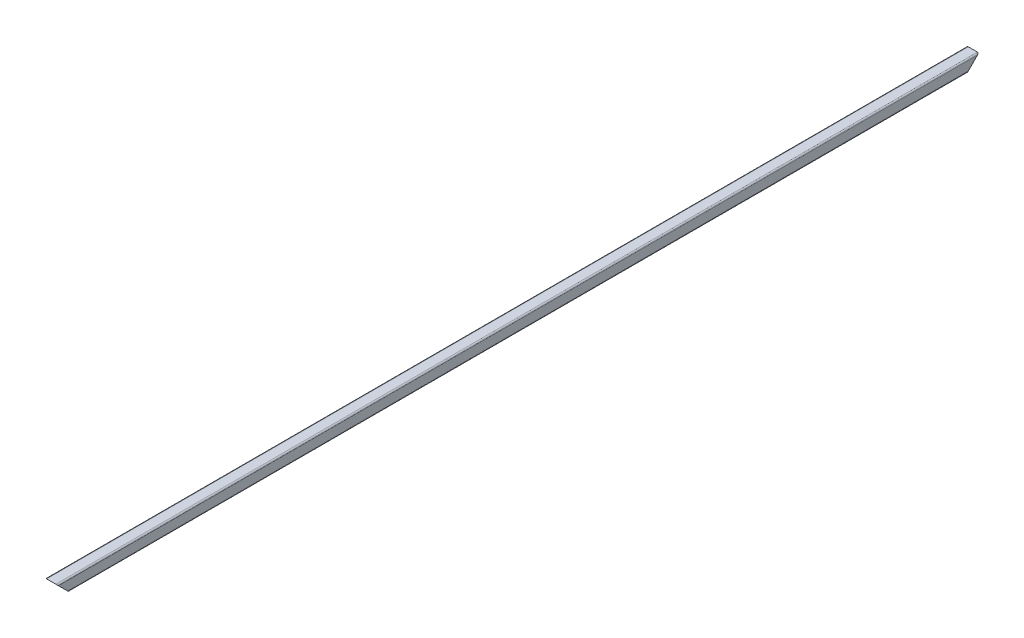
ISO-10303-21;
HEADER;
FILE_DESCRIPTION(('STEP AP214'),'2;1');
FILE_NAME('part.step','',(''),(''),'','','');
FILE_SCHEMA(('AUTOMOTIVE_DESIGN { 1 0 10303 214 1 1 1 1 }'));
ENDSEC;
DATA;
#1=APPLICATION_CONTEXT('core data for automotive mechanical design processes');
#2=APPLICATION_PROTOCOL_DEFINITION('international standard','automotive_design',2000,#1);
#3=PRODUCT_CONTEXT('',#1,'mechanical');
#4=PRODUCT('Part','Part','',(#3));
#5=PRODUCT_RELATED_PRODUCT_CATEGORY('part','',(#4));
#6=PRODUCT_DEFINITION_FORMATION('','',#4);
#7=PRODUCT_DEFINITION_CONTEXT('part definition',#1,'design');
#8=PRODUCT_DEFINITION('design','',#6,#7);
#9=PRODUCT_DEFINITION_SHAPE('','',#8);
#10=(LENGTH_UNIT() NAMED_UNIT(*) SI_UNIT(.MILLI.,.METRE.));
#11=(NAMED_UNIT(*) PLANE_ANGLE_UNIT() SI_UNIT($,.RADIAN.));
#12=(NAMED_UNIT(*) SI_UNIT($,.STERADIAN.) SOLID_ANGLE_UNIT());
#13=UNCERTAINTY_MEASURE_WITH_UNIT(LENGTH_MEASURE(1.E-05),#10,'distance_accuracy_value','');
#14=(GEOMETRIC_REPRESENTATION_CONTEXT(3) GLOBAL_UNCERTAINTY_ASSIGNED_CONTEXT((#13)) GLOBAL_UNIT_ASSIGNED_CONTEXT((#10,
#11,#12)) REPRESENTATION_CONTEXT('',''));
#15=CARTESIAN_POINT('',(0.,0.,0.));
#16=DIRECTION('',(0.,0.,1.));
#17=DIRECTION('',(1.,0.,0.));
#18=AXIS2_PLACEMENT_3D('',#15,#16,#17);
#19=CARTESIAN_POINT('',(-15.4999999999954,1944.50000000004,-3060.));
#20=DIRECTION('',(0.,0.,1.));
#21=DIRECTION('',(0.999999999999991,0.,0.));
#22=AXIS2_PLACEMENT_3D('',#19,#20,#21);
#23=CYLINDRICAL_SURFACE('',#22,4.5);
#24=CARTESIAN_POINT('',(-15.4999999999934,1944.50000000004,-15.4999999999976));
#25=DIRECTION('',(0.,-0.707106781186556,0.707106781186548));
#26=DIRECTION('',(0.,0.707106781186556,0.707106781186547));
#27=AXIS2_PLACEMENT_3D('',#24,#25,#26);
#28=ELLIPSE('',#27,6.36396103067893,4.5);
#29=CARTESIAN_POINT('',(-19.9999999999934,1944.50000000004,-15.4999999999998));
#30=VERTEX_POINT('',#29);
#31=CARTESIAN_POINT('',(-15.4999999999959,1940.00000000004,-19.9999999999951));
#32=VERTEX_POINT('',#31);
#33=EDGE_CURVE('E193',#30,#32,#28,.T.);
#34=ORIENTED_EDGE('',*,*,#33,.F.);
#35=DIRECTION('',(0.,0.,1.));
#36=VECTOR('',#35,1.);
#37=CARTESIAN_POINT('',(-19.9999999999956,1944.50000000004,-3060.));
#38=LINE('',#37,#36);
#39=CARTESIAN_POINT('',(-19.9999999999956,1944.50000000004,-3044.5));
#40=VERTEX_POINT('',#39);
#41=EDGE_CURVE('E69',#40,#30,#38,.T.);
#42=ORIENTED_EDGE('',*,*,#41,.F.);
#43=CARTESIAN_POINT('',(-15.4999999999956,1944.50000000004,-3044.5));
#44=DIRECTION('',(0.,-0.707106781186556,-0.707106781186548));
#45=DIRECTION('',(0.,-0.707106781186556,0.707106781186547));
#46=AXIS2_PLACEMENT_3D('',#43,#44,#45);
#47=ELLIPSE('',#46,6.36396103067893,4.5);
#48=CARTESIAN_POINT('',(-15.4999999999954,1940.00000000004,-3040.));
#49=VERTEX_POINT('',#48);
#50=EDGE_CURVE('E210',#49,#40,#47,.T.);
#51=ORIENTED_EDGE('',*,*,#50,.F.);
#52=DIRECTION('',(0.,0.,1.));
#53=VECTOR('',#52,1.);
#54=CARTESIAN_POINT('',(-15.499999999995,1940.00000000004,-3060.));
#55=LINE('',#54,#53);
#56=EDGE_CURVE('E235',#49,#32,#55,.T.);
#57=ORIENTED_EDGE('',*,*,#56,.T.);
#58=EDGE_LOOP('',(#34,#42,#51,#57));
#59=FACE_BOUND('',#58,.T.);
#60=ADVANCED_FACE('F54',(#59),#23,.T.);
#61=CARTESIAN_POINT('',(-19.9999999999956,1944.50000000004,-3060.));
#62=DIRECTION('',(0.999999999999991,0.,0.));
#63=DIRECTION('',(0.,0.,-1.));
#64=AXIS2_PLACEMENT_3D('',#61,#62,#63);
#65=PLANE('',#64);
#66=DIRECTION('',(0.,-0.707106781186556,-0.707106781186547));
#67=VECTOR('',#66,1.);
#68=CARTESIAN_POINT('',(-20.0000000000022,422.250000000009,-1537.75));
#69=LINE('',#68,#67);
#70=CARTESIAN_POINT('',(-19.9999999999956,1975.50000000003,15.4999999999979));
#71=VERTEX_POINT('',#70);
#72=EDGE_CURVE('E289',#71,#30,#69,.T.);
#73=ORIENTED_EDGE('',*,*,#72,.F.);
#74=DIRECTION('',(0.,0.,1.));
#75=VECTOR('',#74,1.);
#76=CARTESIAN_POINT('',(-19.9999999999978,1975.50000000004,-3060.00000000001));
#77=LINE('',#76,#75);
#78=CARTESIAN_POINT('',(-20.,1975.50000000003,-3075.50000000001));
#79=VERTEX_POINT('',#78);
#80=EDGE_CURVE('E207',#79,#71,#77,.T.);
#81=ORIENTED_EDGE('',*,*,#80,.F.);
#82=DIRECTION('',(0.,0.707106781186556,-0.707106781186547));
#83=VECTOR('',#82,1.);
#84=CARTESIAN_POINT('',(-19.9999999999978,1952.25000000003,-3052.25));
#85=LINE('',#84,#83);
#86=EDGE_CURVE('E359',#40,#79,#85,.T.);
#87=ORIENTED_EDGE('',*,*,#86,.F.);
#88=ORIENTED_EDGE('',*,*,#41,.T.);
#89=EDGE_LOOP('',(#73,#81,#87,#88));
#90=FACE_BOUND('',#89,.T.);
#91=ADVANCED_FACE('F373',(#90),#65,.F.);
#92=CARTESIAN_POINT('',(-15.4999999999978,1975.50000000004,-3060.));
#93=DIRECTION('',(0.,0.,1.));
#94=DIRECTION('',(0.999999999999991,0.,0.));
#95=AXIS2_PLACEMENT_3D('',#92,#93,#94);
#96=CYLINDRICAL_SURFACE('',#95,4.5);
#97=CARTESIAN_POINT('',(-15.4999999999956,1975.50000000004,15.5000000000016));
#98=DIRECTION('',(0.,-0.707106781186556,0.707106781186548));
#99=DIRECTION('',(0.,0.707106781186556,0.707106781186547));
#100=AXIS2_PLACEMENT_3D('',#97,#98,#99);
#101=ELLIPSE('',#100,6.36396103067893,4.5);
#102=CARTESIAN_POINT('',(-15.4999999999978,1980.00000000003,20.0000000000014));
#103=VERTEX_POINT('',#102);
#104=EDGE_CURVE('E293',#103,#71,#101,.T.);
#105=ORIENTED_EDGE('',*,*,#104,.F.);
#106=DIRECTION('',(0.,0.,1.));
#107=VECTOR('',#106,1.);
#108=CARTESIAN_POINT('',(-15.4999999999979,1980.00000000004,-3060.));
#109=LINE('',#108,#107);
#110=CARTESIAN_POINT('',(-15.4999999999979,1980.00000000003,-3080.));
#111=VERTEX_POINT('',#110);
#112=EDGE_CURVE('E254',#111,#103,#109,.T.);
#113=ORIENTED_EDGE('',*,*,#112,.F.);
#114=CARTESIAN_POINT('',(-15.4999999999998,1975.50000000004,-3075.5));
#115=DIRECTION('',(0.,-0.707106781186556,-0.707106781186548));
#116=DIRECTION('',(0.,-0.707106781186556,0.707106781186547));
#117=AXIS2_PLACEMENT_3D('',#114,#115,#116);
#118=ELLIPSE('',#117,6.36396103067893,4.5);
#119=EDGE_CURVE('E356',#79,#111,#118,.T.);
#120=ORIENTED_EDGE('',*,*,#119,.F.);
#121=ORIENTED_EDGE('',*,*,#80,.T.);
#122=EDGE_LOOP('',(#105,#113,#120,#121));
#123=FACE_BOUND('',#122,.T.);
#124=ADVANCED_FACE('F375',(#123),#96,.T.);
#125=CARTESIAN_POINT('',(-15.4999999999979,1980.00000000004,-3060.));
#126=DIRECTION('',(0.,-1.00000000000002,0.));
#127=DIRECTION('',(0.,0.,-1.));
#128=AXIS2_PLACEMENT_3D('',#125,#126,#127);
#129=PLANE('',#128);
#130=DIRECTION('',(-0.999999999999991,0.,0.));
#131=VECTOR('',#130,1.);
#132=CARTESIAN_POINT('',(-15.4999999999978,1980.00000000003,20.0000000000022));
#133=LINE('',#132,#131);
#134=CARTESIAN_POINT('',(15.5000000000023,1980.00000000003,20.0000000000005));
#135=VERTEX_POINT('',#134);
#136=EDGE_CURVE('E297',#135,#103,#133,.T.);
#137=ORIENTED_EDGE('',*,*,#136,.F.);
#138=DIRECTION('',(0.,0.,1.));
#139=VECTOR('',#138,1.);
#140=CARTESIAN_POINT('',(15.5000000000023,1980.00000000003,-3060.));
#141=LINE('',#140,#139);
#142=CARTESIAN_POINT('',(15.5000000000023,1980.00000000003,-3080.));
#143=VERTEX_POINT('',#142);
#144=EDGE_CURVE('E250',#143,#135,#141,.T.);
#145=ORIENTED_EDGE('',*,*,#144,.F.);
#146=DIRECTION('',(0.999999999999991,0.,0.));
#147=VECTOR('',#146,1.);
#148=CARTESIAN_POINT('',(-15.4999999999979,1980.00000000003,-3080.));
#149=LINE('',#148,#147);
#150=EDGE_CURVE('E352',#111,#143,#149,.T.);
#151=ORIENTED_EDGE('',*,*,#150,.F.);
#152=ORIENTED_EDGE('',*,*,#112,.T.);
#153=EDGE_LOOP('',(#137,#145,#151,#152));
#154=FACE_BOUND('',#153,.T.);
#155=ADVANCED_FACE('F379',(#154),#129,.F.);
#156=CARTESIAN_POINT('',(15.5000000000023,1975.50000000004,-3060.));
#157=DIRECTION('',(0.,0.,1.));
#158=DIRECTION('',(0.999999999999991,0.,0.));
#159=AXIS2_PLACEMENT_3D('',#156,#157,#158);
#160=CYLINDRICAL_SURFACE('',#159,4.5);
#161=CARTESIAN_POINT('',(15.500000000004,1975.50000000003,15.5000000000016));
#162=DIRECTION('',(0.,-0.707106781186556,0.707106781186548));
#163=DIRECTION('',(0.,0.707106781186556,0.707106781186547));
#164=AXIS2_PLACEMENT_3D('',#161,#162,#163);
#165=ELLIPSE('',#164,6.36396103067893,4.5);
#166=CARTESIAN_POINT('',(20.0000000000042,1975.50000000004,15.4999999999994));
#167=VERTEX_POINT('',#166);
#168=EDGE_CURVE('E301',#167,#135,#165,.T.);
#169=ORIENTED_EDGE('',*,*,#168,.F.);
#170=DIRECTION('',(0.,0.,1.));
#171=VECTOR('',#170,1.);
#172=CARTESIAN_POINT('',(20.0000000000022,1975.50000000004,-3060.));
#173=LINE('',#172,#171);
#174=CARTESIAN_POINT('',(20.,1975.50000000004,-3075.5));
#175=VERTEX_POINT('',#174);
#176=EDGE_CURVE('E246',#175,#167,#173,.T.);
#177=ORIENTED_EDGE('',*,*,#176,.F.);
#178=CARTESIAN_POINT('',(15.5,1975.50000000003,-3075.5));
#179=DIRECTION('',(0.,-0.707106781186556,-0.707106781186548));
#180=DIRECTION('',(0.,-0.707106781186556,0.707106781186547));
#181=AXIS2_PLACEMENT_3D('',#178,#179,#180);
#182=ELLIPSE('',#181,6.36396103067893,4.5);
#183=EDGE_CURVE('E348',#143,#175,#182,.T.);
#184=ORIENTED_EDGE('',*,*,#183,.F.);
#185=ORIENTED_EDGE('',*,*,#144,.T.);
#186=EDGE_LOOP('',(#169,#177,#184,#185));
#187=FACE_BOUND('',#186,.T.);
#188=ADVANCED_FACE('F381',(#187),#160,.T.);
#189=CARTESIAN_POINT('',(20.0000000000044,1944.50000000004,-3060.));
#190=DIRECTION('',(-0.999999999999991,0.,0.));
#191=DIRECTION('',(0.,0.,1.));
#192=AXIS2_PLACEMENT_3D('',#189,#190,#191);
#193=PLANE('',#192);
#194=DIRECTION('',(0.,0.707106781186556,0.707106781186547));
#195=VECTOR('',#194,1.);
#196=CARTESIAN_POINT('',(19.9999999999978,422.250000000007,-1537.75));
#197=LINE('',#196,#195);
#198=CARTESIAN_POINT('',(20.0000000000051,1944.50000000004,-15.4999999999981));
#199=VERTEX_POINT('',#198);
#200=EDGE_CURVE('E305',#199,#167,#197,.T.);
#201=ORIENTED_EDGE('',*,*,#200,.F.);
#202=DIRECTION('',(0.,0.,1.));
#203=VECTOR('',#202,1.);
#204=CARTESIAN_POINT('',(20.0000000000044,1944.50000000004,-3060.));
#205=LINE('',#204,#203);
#206=CARTESIAN_POINT('',(20.0000000000044,1944.50000000004,-3044.5));
#207=VERTEX_POINT('',#206);
#208=EDGE_CURVE('E242',#207,#199,#205,.T.);
#209=ORIENTED_EDGE('',*,*,#208,.F.);
#210=DIRECTION('',(0.,-0.707106781186556,0.707106781186547));
#211=VECTOR('',#210,1.);
#212=CARTESIAN_POINT('',(20.0000000000009,1952.25000000004,-3052.24999999999));
#213=LINE('',#212,#211);
#214=EDGE_CURVE('E344',#175,#207,#213,.T.);
#215=ORIENTED_EDGE('',*,*,#214,.F.);
#216=ORIENTED_EDGE('',*,*,#176,.T.);
#217=EDGE_LOOP('',(#201,#209,#215,#216));
#218=FACE_BOUND('',#217,.T.);
#219=ADVANCED_FACE('F385',(#218),#193,.F.);
#220=CARTESIAN_POINT('',(15.5000000000045,1944.50000000004,-3060.));
#221=DIRECTION('',(0.,0.,1.));
#222=DIRECTION('',(0.999999999999991,0.,0.));
#223=AXIS2_PLACEMENT_3D('',#220,#221,#222);
#224=CYLINDRICAL_SURFACE('',#223,4.5);
#225=CARTESIAN_POINT('',(15.5000000000063,1944.50000000004,-15.4999999999976));
#226=DIRECTION('',(0.,-0.707106781186556,0.707106781186548));
#227=DIRECTION('',(0.,0.707106781186556,0.707106781186547));
#228=AXIS2_PLACEMENT_3D('',#225,#226,#227);
#229=ELLIPSE('',#228,6.36396103067893,4.5);
#230=CARTESIAN_POINT('',(15.5000000000027,1940.00000000004,-19.9999999999974));
#231=VERTEX_POINT('',#230);
#232=EDGE_CURVE('E309',#231,#199,#229,.T.);
#233=ORIENTED_EDGE('',*,*,#232,.F.);
#234=DIRECTION('',(0.,0.,1.));
#235=VECTOR('',#234,1.);
#236=CARTESIAN_POINT('',(15.5000000000045,1940.00000000004,-3060.));
#237=LINE('',#236,#235);
#238=CARTESIAN_POINT('',(15.5000000000045,1940.00000000004,-3040.));
#239=VERTEX_POINT('',#238);
#240=EDGE_CURVE('E238',#239,#231,#237,.T.);
#241=ORIENTED_EDGE('',*,*,#240,.F.);
#242=CARTESIAN_POINT('',(15.5000000000045,1944.50000000004,-3044.5));
#243=DIRECTION('',(0.,-0.707106781186556,-0.707106781186548));
#244=DIRECTION('',(0.,-0.707106781186556,0.707106781186547));
#245=AXIS2_PLACEMENT_3D('',#242,#243,#244);
#246=ELLIPSE('',#245,6.36396103067893,4.5);
#247=EDGE_CURVE('E340',#207,#239,#246,.T.);
#248=ORIENTED_EDGE('',*,*,#247,.F.);
#249=ORIENTED_EDGE('',*,*,#208,.T.);
#250=EDGE_LOOP('',(#233,#241,#248,#249));
#251=FACE_BOUND('',#250,.T.);
#252=ADVANCED_FACE('F387',(#251),#224,.T.);
#253=CARTESIAN_POINT('',(-15.499999999995,1940.00000000004,-3060.));
#254=DIRECTION('',(0.,1.00000000000002,0.));
#255=DIRECTION('',(0.,0.,1.));
#256=AXIS2_PLACEMENT_3D('',#253,#254,#255);
#257=PLANE('',#256);
#258=DIRECTION('',(0.999999999999991,0.,0.));
#259=VECTOR('',#258,1.);
#260=CARTESIAN_POINT('',(-15.4999999999959,1940.00000000004,-19.999999999996));
#261=LINE('',#260,#259);
#262=EDGE_CURVE('E273',#32,#231,#261,.T.);
#263=ORIENTED_EDGE('',*,*,#262,.F.);
#264=ORIENTED_EDGE('',*,*,#56,.F.);
#265=DIRECTION('',(-0.999999999999991,0.,0.));
#266=VECTOR('',#265,1.);
#267=CARTESIAN_POINT('',(-15.4999999999954,1940.00000000004,-3040.));
#268=LINE('',#267,#266);
#269=EDGE_CURVE('E336',#239,#49,#268,.T.);
#270=ORIENTED_EDGE('',*,*,#269,.F.);
#271=ORIENTED_EDGE('',*,*,#240,.T.);
#272=EDGE_LOOP('',(#263,#264,#270,#271));
#273=FACE_BOUND('',#272,.T.);
#274=ADVANCED_FACE('F389',(#273),#257,.F.);
#275=CARTESIAN_POINT('',(2.2065682614425E-12,1960.00000000004,-3060.00000000001));
#276=DIRECTION('',(0.,-0.707106781186556,-0.707106781186548));
#277=DIRECTION('',(0.,0.707106781186556,-0.707106781186547));
#278=AXIS2_PLACEMENT_3D('',#275,#276,#277);
#279=PLANE('',#278);
#280=CARTESIAN_POINT('',(-14.9999999999955,1945.00000000004,-3045.));
#281=DIRECTION('',(0.,-0.707106781186556,-0.707106781186548));
#282=DIRECTION('',(0.,-0.707106781186556,0.707106781186547));
#283=AXIS2_PLACEMENT_3D('',#280,#281,#282);
#284=ELLIPSE('',#283,4.24264068711928,3.);
#285=CARTESIAN_POINT('',(-14.9999999999955,1942.00000000004,-3042.));
#286=VERTEX_POINT('',#285);
#287=CARTESIAN_POINT('',(-17.9999999999956,1945.00000000003,-3045.));
#288=VERTEX_POINT('',#287);
#289=EDGE_CURVE('E198',#286,#288,#284,.T.);
#290=ORIENTED_EDGE('',*,*,#289,.F.);
#291=DIRECTION('',(-0.999999999999991,0.,0.));
#292=VECTOR('',#291,1.);
#293=CARTESIAN_POINT('',(-14.9999999999955,1942.00000000004,-3042.));
#294=LINE('',#293,#292);
#295=CARTESIAN_POINT('',(15.0000000000045,1942.00000000003,-3042.));
#296=VERTEX_POINT('',#295);
#297=EDGE_CURVE('E330',#296,#286,#294,.T.);
#298=ORIENTED_EDGE('',*,*,#297,.F.);
#299=CARTESIAN_POINT('',(15.0000000000045,1945.00000000003,-3045.));
#300=DIRECTION('',(0.,-0.707106781186556,-0.707106781186548));
#301=DIRECTION('',(0.,-0.707106781186556,0.707106781186547));
#302=AXIS2_PLACEMENT_3D('',#299,#300,#301);
#303=ELLIPSE('',#302,4.24264068711928,3.);
#304=CARTESIAN_POINT('',(18.0000000000044,1945.00000000004,-3045.00000000001));
#305=VERTEX_POINT('',#304);
#306=EDGE_CURVE('E326',#305,#296,#303,.T.);
#307=ORIENTED_EDGE('',*,*,#306,.F.);
#308=DIRECTION('',(0.,-0.707106781186556,0.707106781186547));
#309=VECTOR('',#308,1.);
#310=CARTESIAN_POINT('',(18.000000000002,1952.50000000004,-3052.5));
#311=LINE('',#310,#309);
#312=CARTESIAN_POINT('',(18.0000000000022,1975.00000000004,-3075.));
#313=VERTEX_POINT('',#312);
#314=EDGE_CURVE('E322',#313,#305,#311,.T.);
#315=ORIENTED_EDGE('',*,*,#314,.F.);
#316=CARTESIAN_POINT('',(15.0000000000023,1975.00000000004,-3075.));
#317=DIRECTION('',(0.,-0.707106781186556,-0.707106781186548));
#318=DIRECTION('',(0.,-0.707106781186556,0.707106781186547));
#319=AXIS2_PLACEMENT_3D('',#316,#317,#318);
#320=ELLIPSE('',#319,4.24264068711928,3.);
#321=CARTESIAN_POINT('',(15.0000000000023,1978.00000000004,-3078.));
#322=VERTEX_POINT('',#321);
#323=EDGE_CURVE('E318',#322,#313,#320,.T.);
#324=ORIENTED_EDGE('',*,*,#323,.F.);
#325=DIRECTION('',(0.999999999999991,0.,0.));
#326=VECTOR('',#325,1.);
#327=CARTESIAN_POINT('',(-14.9999999999977,1978.00000000004,-3078.));
#328=LINE('',#327,#326);
#329=CARTESIAN_POINT('',(-14.9999999999977,1978.00000000004,-3078.));
#330=VERTEX_POINT('',#329);
#331=EDGE_CURVE('E269',#330,#322,#328,.T.);
#332=ORIENTED_EDGE('',*,*,#331,.F.);
#333=CARTESIAN_POINT('',(-14.9999999999977,1975.00000000004,-3074.99999999999));
#334=DIRECTION('',(0.,-0.707106781186556,-0.707106781186548));
#335=DIRECTION('',(0.,-0.707106781186556,0.707106781186547));
#336=AXIS2_PLACEMENT_3D('',#333,#334,#335);
#337=ELLIPSE('',#336,4.24264068711928,3.);
#338=CARTESIAN_POINT('',(-17.9999999999978,1975.00000000004,-3075.));
#339=VERTEX_POINT('',#338);
#340=EDGE_CURVE('E267',#339,#330,#337,.T.);
#341=ORIENTED_EDGE('',*,*,#340,.F.);
#342=DIRECTION('',(0.,0.707106781186556,-0.707106781186547));
#343=VECTOR('',#342,1.);
#344=CARTESIAN_POINT('',(-17.9999999999978,1952.50000000004,-3052.5));
#345=LINE('',#344,#343);
#346=EDGE_CURVE('E62',#288,#339,#345,.T.);
#347=ORIENTED_EDGE('',*,*,#346,.F.);
#348=EDGE_LOOP('',(#290,#298,#307,#315,#324,#332,#341,#347));
#349=FACE_BOUND('',#348,.T.);
#350=ORIENTED_EDGE('',*,*,#269,.T.);
#351=ORIENTED_EDGE('',*,*,#50,.T.);
#352=ORIENTED_EDGE('',*,*,#86,.T.);
#353=ORIENTED_EDGE('',*,*,#119,.T.);
#354=ORIENTED_EDGE('',*,*,#150,.T.);
#355=ORIENTED_EDGE('',*,*,#183,.T.);
#356=ORIENTED_EDGE('',*,*,#214,.T.);
#357=ORIENTED_EDGE('',*,*,#247,.T.);
#358=EDGE_LOOP('',(#350,#351,#352,#353,#354,#355,#356,#357));
#359=FACE_BOUND('',#358,.T.);
#360=ADVANCED_FACE('F264',(#349,#359),#279,.T.);
#361=CARTESIAN_POINT('',(-14.9999999999955,1945.00000000004,-3060.));
#362=DIRECTION('',(0.,0.,1.));
#363=DIRECTION('',(0.999999999999991,0.,0.));
#364=AXIS2_PLACEMENT_3D('',#361,#362,#363);
#365=CYLINDRICAL_SURFACE('',#364,3.);
#366=DIRECTION('',(0.,0.,1.));
#367=VECTOR('',#366,1.);
#368=CARTESIAN_POINT('',(-17.9999999999956,1945.00000000004,-3060.));
#369=LINE('',#368,#367);
#370=CARTESIAN_POINT('',(-17.9999999999956,1945.00000000003,-15.0000000000019));
#371=VERTEX_POINT('',#370);
#372=EDGE_CURVE('E188',#288,#371,#369,.T.);
#373=ORIENTED_EDGE('',*,*,#372,.T.);
#374=CARTESIAN_POINT('',(-14.9999999999957,1945.00000000004,-14.9999999999997));
#375=DIRECTION('',(0.,-0.707106781186556,0.707106781186548));
#376=DIRECTION('',(0.,0.707106781186556,0.707106781186547));
#377=AXIS2_PLACEMENT_3D('',#374,#375,#376);
#378=ELLIPSE('',#377,4.24264068711928,3.);
#379=CARTESIAN_POINT('',(-14.9999999999957,1942.00000000004,-18.0000000000002));
#380=VERTEX_POINT('',#379);
#381=EDGE_CURVE('E13',#371,#380,#378,.T.);
#382=ORIENTED_EDGE('',*,*,#381,.T.);
#383=DIRECTION('',(0.,0.,1.));
#384=VECTOR('',#383,1.);
#385=CARTESIAN_POINT('',(-14.9999999999955,1942.00000000004,-3060.));
#386=LINE('',#385,#384);
#387=EDGE_CURVE('E232',#286,#380,#386,.T.);
#388=ORIENTED_EDGE('',*,*,#387,.F.);
#389=ORIENTED_EDGE('',*,*,#289,.T.);
#390=EDGE_LOOP('',(#373,#382,#388,#389));
#391=FACE_BOUND('',#390,.T.);
#392=ADVANCED_FACE('F197',(#391),#365,.F.);
#393=CARTESIAN_POINT('',(-14.9999999999955,1942.00000000004,-3060.));
#394=DIRECTION('',(0.,1.00000000000002,0.));
#395=DIRECTION('',(0.,0.,1.));
#396=AXIS2_PLACEMENT_3D('',#393,#394,#395);
#397=PLANE('',#396);
#398=ORIENTED_EDGE('',*,*,#387,.T.);
#399=DIRECTION('',(0.999999999999991,0.,0.));
#400=VECTOR('',#399,1.);
#401=CARTESIAN_POINT('',(-14.9999999999957,1942.00000000004,-18.0000000000002));
#402=LINE('',#401,#400);
#403=CARTESIAN_POINT('',(15.0000000000041,1942.00000000003,-18.0000000000025));
#404=VERTEX_POINT('',#403);
#405=EDGE_CURVE('E77',#380,#404,#402,.T.);
#406=ORIENTED_EDGE('',*,*,#405,.T.);
#407=DIRECTION('',(0.,0.,1.));
#408=VECTOR('',#407,1.);
#409=CARTESIAN_POINT('',(15.0000000000045,1942.00000000004,-3060.));
#410=LINE('',#409,#408);
#411=EDGE_CURVE('E228',#296,#404,#410,.T.);
#412=ORIENTED_EDGE('',*,*,#411,.F.);
#413=ORIENTED_EDGE('',*,*,#297,.T.);
#414=EDGE_LOOP('',(#398,#406,#412,#413));
#415=FACE_BOUND('',#414,.T.);
#416=ADVANCED_FACE('F448',(#415),#397,.T.);
#417=CARTESIAN_POINT('',(15.0000000000045,1945.00000000004,-3060.));
#418=DIRECTION('',(0.,0.,1.));
#419=DIRECTION('',(0.999999999999991,0.,0.));
#420=AXIS2_PLACEMENT_3D('',#417,#418,#419);
#421=CYLINDRICAL_SURFACE('',#420,3.);
#422=ORIENTED_EDGE('',*,*,#411,.T.);
#423=CARTESIAN_POINT('',(15.0000000000041,1945.00000000003,-14.9999999999997));
#424=DIRECTION('',(0.,-0.707106781186556,0.707106781186548));
#425=DIRECTION('',(0.,0.707106781186556,0.707106781186547));
#426=AXIS2_PLACEMENT_3D('',#423,#424,#425);
#427=ELLIPSE('',#426,4.24264068711928,3.);
#428=CARTESIAN_POINT('',(18.0000000000042,1945.00000000004,-15.0000000000019));
#429=VERTEX_POINT('',#428);
#430=EDGE_CURVE('E514',#404,#429,#427,.T.);
#431=ORIENTED_EDGE('',*,*,#430,.T.);
#432=DIRECTION('',(0.,0.,1.));
#433=VECTOR('',#432,1.);
#434=CARTESIAN_POINT('',(18.0000000000044,1945.00000000004,-3060.));
#435=LINE('',#434,#433);
#436=EDGE_CURVE('E224',#305,#429,#435,.T.);
#437=ORIENTED_EDGE('',*,*,#436,.F.);
#438=ORIENTED_EDGE('',*,*,#306,.T.);
#439=EDGE_LOOP('',(#422,#431,#437,#438));
#440=FACE_BOUND('',#439,.T.);
#441=ADVANCED_FACE('F454',(#440),#421,.F.);
#442=CARTESIAN_POINT('',(18.0000000000044,1945.00000000004,-3060.));
#443=DIRECTION('',(-0.999999999999991,0.,0.));
#444=DIRECTION('',(0.,0.,1.));
#445=AXIS2_PLACEMENT_3D('',#442,#443,#444);
#446=PLANE('',#445);
#447=ORIENTED_EDGE('',*,*,#436,.T.);
#448=DIRECTION('',(0.,0.707106781186556,0.707106781186547));
#449=VECTOR('',#448,1.);
#450=CARTESIAN_POINT('',(17.9999999999978,422.500000000009,-1537.5));
#451=LINE('',#450,#449);
#452=CARTESIAN_POINT('',(18.0000000000042,1975.00000000004,14.9999999999997));
#453=VERTEX_POINT('',#452);
#454=EDGE_CURVE('E511',#429,#453,#451,.T.);
#455=ORIENTED_EDGE('',*,*,#454,.T.);
#456=DIRECTION('',(0.,0.,1.));
#457=VECTOR('',#456,1.);
#458=CARTESIAN_POINT('',(18.0000000000022,1975.00000000004,-3060.));
#459=LINE('',#458,#457);
#460=EDGE_CURVE('E220',#313,#453,#459,.T.);
#461=ORIENTED_EDGE('',*,*,#460,.F.);
#462=ORIENTED_EDGE('',*,*,#314,.T.);
#463=EDGE_LOOP('',(#447,#455,#461,#462));
#464=FACE_BOUND('',#463,.T.);
#465=ADVANCED_FACE('F462',(#464),#446,.T.);
#466=CARTESIAN_POINT('',(15.0000000000021,1975.00000000004,-3060.));
#467=DIRECTION('',(0.,0.,1.));
#468=DIRECTION('',(0.999999999999991,0.,0.));
#469=AXIS2_PLACEMENT_3D('',#466,#467,#468);
#470=CYLINDRICAL_SURFACE('',#469,3.);
#471=ORIENTED_EDGE('',*,*,#460,.T.);
#472=CARTESIAN_POINT('',(15.0000000000041,1975.00000000004,14.9999999999992));
#473=DIRECTION('',(0.,-0.707106781186556,0.707106781186548));
#474=DIRECTION('',(0.,0.707106781186556,0.707106781186547));
#475=AXIS2_PLACEMENT_3D('',#472,#473,#474);
#476=ELLIPSE('',#475,4.24264068711928,3.);
#477=CARTESIAN_POINT('',(15.0000000000043,1978.00000000004,17.9999999999998));
#478=VERTEX_POINT('',#477);
#479=EDGE_CURVE('E282',#453,#478,#476,.T.);
#480=ORIENTED_EDGE('',*,*,#479,.T.);
#481=DIRECTION('',(0.,0.,1.));
#482=VECTOR('',#481,1.);
#483=CARTESIAN_POINT('',(15.0000000000021,1978.00000000004,-3060.));
#484=LINE('',#483,#482);
#485=EDGE_CURVE('E216',#322,#478,#484,.T.);
#486=ORIENTED_EDGE('',*,*,#485,.F.);
#487=ORIENTED_EDGE('',*,*,#323,.T.);
#488=EDGE_LOOP('',(#471,#480,#486,#487));
#489=FACE_BOUND('',#488,.T.);
#490=ADVANCED_FACE('F470',(#489),#470,.F.);
#491=CARTESIAN_POINT('',(-14.9999999999977,1978.00000000004,-3060.));
#492=DIRECTION('',(0.,-1.00000000000002,0.));
#493=DIRECTION('',(0.,0.,-1.));
#494=AXIS2_PLACEMENT_3D('',#491,#492,#493);
#495=PLANE('',#494);
#496=ORIENTED_EDGE('',*,*,#485,.T.);
#497=DIRECTION('',(-0.999999999999991,0.,0.));
#498=VECTOR('',#497,1.);
#499=CARTESIAN_POINT('',(-14.9999999999957,1978.00000000004,18.000000000002));
#500=LINE('',#499,#498);
#501=CARTESIAN_POINT('',(-14.9999999999957,1978.00000000004,18.000000000002));
#502=VERTEX_POINT('',#501);
#503=EDGE_CURVE('E278',#478,#502,#500,.T.);
#504=ORIENTED_EDGE('',*,*,#503,.T.);
#505=DIRECTION('',(0.,0.,1.));
#506=VECTOR('',#505,1.);
#507=CARTESIAN_POINT('',(-14.9999999999977,1978.00000000004,-3060.));
#508=LINE('',#507,#506);
#509=EDGE_CURVE('E205',#330,#502,#508,.T.);
#510=ORIENTED_EDGE('',*,*,#509,.F.);
#511=ORIENTED_EDGE('',*,*,#331,.T.);
#512=EDGE_LOOP('',(#496,#504,#510,#511));
#513=FACE_BOUND('',#512,.T.);
#514=ADVANCED_FACE('F478',(#513),#495,.T.);
#515=CARTESIAN_POINT('',(-14.9999999999977,1975.00000000004,-3059.99999999999));
#516=DIRECTION('',(0.,0.,1.));
#517=DIRECTION('',(0.999999999999991,0.,0.));
#518=AXIS2_PLACEMENT_3D('',#515,#516,#517);
#519=CYLINDRICAL_SURFACE('',#518,3.);
#520=ORIENTED_EDGE('',*,*,#509,.T.);
#521=CARTESIAN_POINT('',(-14.9999999999957,1975.00000000004,14.9999999999992));
#522=DIRECTION('',(0.,-0.707106781186556,0.707106781186548));
#523=DIRECTION('',(0.,0.707106781186556,0.707106781186547));
#524=AXIS2_PLACEMENT_3D('',#521,#522,#523);
#525=ELLIPSE('',#524,4.24264068711928,3.);
#526=CARTESIAN_POINT('',(-17.9999999999956,1975.00000000004,14.9999999999992));
#527=VERTEX_POINT('',#526);
#528=EDGE_CURVE('E194',#502,#527,#525,.T.);
#529=ORIENTED_EDGE('',*,*,#528,.T.);
#530=DIRECTION('',(0.,0.,1.));
#531=VECTOR('',#530,1.);
#532=CARTESIAN_POINT('',(-17.9999999999978,1975.00000000004,-3060.));
#533=LINE('',#532,#531);
#534=EDGE_CURVE('E190',#339,#527,#533,.T.);
#535=ORIENTED_EDGE('',*,*,#534,.F.);
#536=ORIENTED_EDGE('',*,*,#340,.T.);
#537=EDGE_LOOP('',(#520,#529,#535,#536));
#538=FACE_BOUND('',#537,.T.);
#539=ADVANCED_FACE('F275',(#538),#519,.F.);
#540=CARTESIAN_POINT('',(-17.9999999999956,1945.00000000004,-3060.));
#541=DIRECTION('',(0.999999999999991,0.,0.));
#542=DIRECTION('',(0.,0.,-1.));
#543=AXIS2_PLACEMENT_3D('',#540,#541,#542);
#544=PLANE('',#543);
#545=ORIENTED_EDGE('',*,*,#534,.T.);
#546=DIRECTION('',(0.,-0.707106781186556,-0.707106781186547));
#547=VECTOR('',#546,1.);
#548=CARTESIAN_POINT('',(-18.0000000000022,422.500000000009,-1537.5));
#549=LINE('',#548,#547);
#550=EDGE_CURVE('E179',#527,#371,#549,.T.);
#551=ORIENTED_EDGE('',*,*,#550,.T.);
#552=ORIENTED_EDGE('',*,*,#372,.F.);
#553=ORIENTED_EDGE('',*,*,#346,.T.);
#554=EDGE_LOOP('',(#545,#551,#552,#553));
#555=FACE_BOUND('',#554,.T.);
#556=ADVANCED_FACE('F186',(#555),#544,.T.);
#557=CARTESIAN_POINT('',(2.20309881449055E-12,1960.00000000004,2.22391549620227E-12));
#558=DIRECTION('',(0.,-0.707106781186556,0.707106781186548));
#559=DIRECTION('',(0.,-0.707106781186556,-0.707106781186547));
#560=AXIS2_PLACEMENT_3D('',#557,#558,#559);
#561=PLANE('',#560);
#562=ORIENTED_EDGE('',*,*,#550,.F.);
#563=ORIENTED_EDGE('',*,*,#528,.F.);
#564=ORIENTED_EDGE('',*,*,#503,.F.);
#565=ORIENTED_EDGE('',*,*,#479,.F.);
#566=ORIENTED_EDGE('',*,*,#454,.F.);
#567=ORIENTED_EDGE('',*,*,#430,.F.);
#568=ORIENTED_EDGE('',*,*,#405,.F.);
#569=ORIENTED_EDGE('',*,*,#381,.F.);
#570=EDGE_LOOP('',(#562,#563,#564,#565,#566,#567,#568,#569));
#571=FACE_BOUND('',#570,.T.);
#572=ORIENTED_EDGE('',*,*,#33,.T.);
#573=ORIENTED_EDGE('',*,*,#262,.T.);
#574=ORIENTED_EDGE('',*,*,#232,.T.);
#575=ORIENTED_EDGE('',*,*,#200,.T.);
#576=ORIENTED_EDGE('',*,*,#168,.T.);
#577=ORIENTED_EDGE('',*,*,#136,.T.);
#578=ORIENTED_EDGE('',*,*,#104,.T.);
#579=ORIENTED_EDGE('',*,*,#72,.T.);
#580=EDGE_LOOP('',(#572,#573,#574,#575,#576,#577,#578,#579));
#581=FACE_BOUND('',#580,.T.);
#582=ADVANCED_FACE('F177',(#571,#581),#561,.T.);
#583=CLOSED_SHELL('',(#60,#91,#124,#155,#188,#219,#252,#274,#360,#392,#416,#441,#465,#490,#514,
#539,#556,#582));
#584=MANIFOLD_SOLID_BREP('B2',#583);
#585=ADVANCED_BREP_SHAPE_REPRESENTATION('',(#18,#584),#14);
#586=SHAPE_DEFINITION_REPRESENTATION(#9,#585);
ENDSEC;
END-ISO-10303-21;
